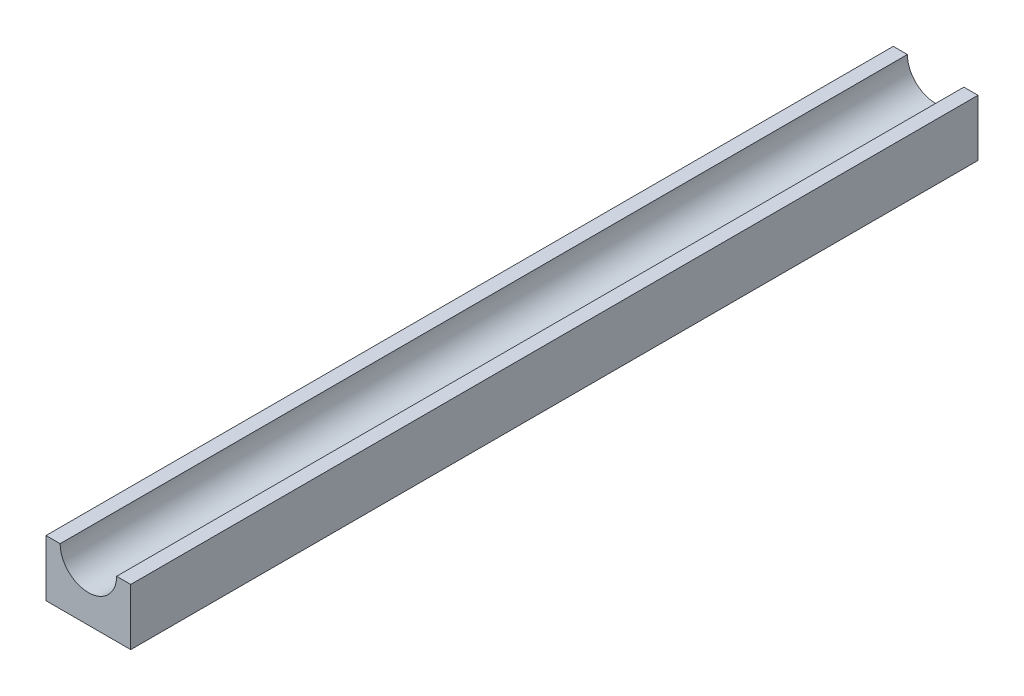
ISO-10303-21;
HEADER;
FILE_DESCRIPTION(('STEP AP214'),'2;1');
FILE_NAME('part.step','',(''),(''),'','','');
FILE_SCHEMA(('AUTOMOTIVE_DESIGN { 1 0 10303 214 1 1 1 1 }'));
ENDSEC;
DATA;
#1=APPLICATION_CONTEXT('core data for automotive mechanical design processes');
#2=APPLICATION_PROTOCOL_DEFINITION('international standard','automotive_design',2000,#1);
#3=PRODUCT_CONTEXT('',#1,'mechanical');
#4=PRODUCT('Part','Part','',(#3));
#5=PRODUCT_RELATED_PRODUCT_CATEGORY('part','',(#4));
#6=PRODUCT_DEFINITION_FORMATION('','',#4);
#7=PRODUCT_DEFINITION_CONTEXT('part definition',#1,'design');
#8=PRODUCT_DEFINITION('design','',#6,#7);
#9=PRODUCT_DEFINITION_SHAPE('','',#8);
#10=(LENGTH_UNIT() NAMED_UNIT(*) SI_UNIT(.MILLI.,.METRE.));
#11=(NAMED_UNIT(*) PLANE_ANGLE_UNIT() SI_UNIT($,.RADIAN.));
#12=(NAMED_UNIT(*) SI_UNIT($,.STERADIAN.) SOLID_ANGLE_UNIT());
#13=UNCERTAINTY_MEASURE_WITH_UNIT(LENGTH_MEASURE(1.E-05),#10,'distance_accuracy_value','');
#14=(GEOMETRIC_REPRESENTATION_CONTEXT(3) GLOBAL_UNCERTAINTY_ASSIGNED_CONTEXT((#13)) GLOBAL_UNIT_ASSIGNED_CONTEXT((#10,
#11,#12)) REPRESENTATION_CONTEXT('',''));
#15=CARTESIAN_POINT('',(0.,0.,0.));
#16=DIRECTION('',(0.,0.,1.));
#17=DIRECTION('',(1.,0.,0.));
#18=AXIS2_PLACEMENT_3D('',#15,#16,#17);
#19=CARTESIAN_POINT('',(0.,5.,150.));
#20=DIRECTION('',(0.,0.,-1.));
#21=DIRECTION('',(-1.,0.,0.));
#22=AXIS2_PLACEMENT_3D('',#19,#20,#21);
#23=CYLINDRICAL_SURFACE('',#22,5.);
#24=CARTESIAN_POINT('',(0.,5.,0.));
#25=DIRECTION('',(0.,0.,1.));
#26=DIRECTION('',(1.,0.,0.));
#27=AXIS2_PLACEMENT_3D('',#24,#25,#26);
#28=CIRCLE('',#27,5.);
#29=CARTESIAN_POINT('',(-5.,5.,0.));
#30=VERTEX_POINT('',#29);
#31=CARTESIAN_POINT('',(5.,5.,0.));
#32=VERTEX_POINT('',#31);
#33=EDGE_CURVE('E244',#30,#32,#28,.T.);
#34=ORIENTED_EDGE('',*,*,#33,.F.);
#35=DIRECTION('',(0.,0.,-1.));
#36=VECTOR('',#35,1.);
#37=CARTESIAN_POINT('',(-5.,5.,150.));
#38=LINE('',#37,#36);
#39=CARTESIAN_POINT('',(-5.,5.,150.));
#40=VERTEX_POINT('',#39);
#41=EDGE_CURVE('E299',#40,#30,#38,.T.);
#42=ORIENTED_EDGE('',*,*,#41,.F.);
#43=CARTESIAN_POINT('',(0.,5.,150.));
#44=DIRECTION('',(0.,0.,1.));
#45=DIRECTION('',(1.,0.,0.));
#46=AXIS2_PLACEMENT_3D('',#43,#44,#45);
#47=CIRCLE('',#46,5.);
#48=CARTESIAN_POINT('',(5.,5.,150.));
#49=VERTEX_POINT('',#48);
#50=EDGE_CURVE('E245',#40,#49,#47,.T.);
#51=ORIENTED_EDGE('',*,*,#50,.T.);
#52=DIRECTION('',(0.,0.,-1.));
#53=VECTOR('',#52,1.);
#54=CARTESIAN_POINT('',(5.,5.,150.));
#55=LINE('',#54,#53);
#56=EDGE_CURVE('E283',#49,#32,#55,.T.);
#57=ORIENTED_EDGE('',*,*,#56,.T.);
#58=EDGE_LOOP('',(#34,#42,#51,#57));
#59=FACE_BOUND('',#58,.T.);
#60=ADVANCED_FACE('F41',(#59),#23,.F.);
#61=CARTESIAN_POINT('',(0.,5.,150.));
#62=DIRECTION('',(0.,1.,0.));
#63=DIRECTION('',(0.,0.,1.));
#64=AXIS2_PLACEMENT_3D('',#61,#62,#63);
#65=PLANE('',#64);
#66=DIRECTION('',(1.,0.,0.));
#67=VECTOR('',#66,1.);
#68=CARTESIAN_POINT('',(0.,5.,0.));
#69=LINE('',#68,#67);
#70=CARTESIAN_POINT('',(-7.5,5.,0.));
#71=VERTEX_POINT('',#70);
#72=EDGE_CURVE('E268',#71,#30,#69,.T.);
#73=ORIENTED_EDGE('',*,*,#72,.F.);
#74=DIRECTION('',(0.,0.,-1.));
#75=VECTOR('',#74,1.);
#76=CARTESIAN_POINT('',(-7.5,5.,150.));
#77=LINE('',#76,#75);
#78=CARTESIAN_POINT('',(-7.5,5.,150.));
#79=VERTEX_POINT('',#78);
#80=EDGE_CURVE('E296',#79,#71,#77,.T.);
#81=ORIENTED_EDGE('',*,*,#80,.F.);
#82=DIRECTION('',(1.,0.,0.));
#83=VECTOR('',#82,1.);
#84=CARTESIAN_POINT('',(0.,5.,150.));
#85=LINE('',#84,#83);
#86=EDGE_CURVE('E249',#79,#40,#85,.T.);
#87=ORIENTED_EDGE('',*,*,#86,.T.);
#88=ORIENTED_EDGE('',*,*,#41,.T.);
#89=EDGE_LOOP('',(#73,#81,#87,#88));
#90=FACE_BOUND('',#89,.T.);
#91=ADVANCED_FACE('F340',(#90),#65,.T.);
#92=CARTESIAN_POINT('',(-7.5,0.,150.));
#93=DIRECTION('',(1.,0.,0.));
#94=DIRECTION('',(0.,1.,0.));
#95=AXIS2_PLACEMENT_3D('',#92,#93,#94);
#96=PLANE('',#95);
#97=DIRECTION('',(0.,-1.,0.));
#98=VECTOR('',#97,1.);
#99=CARTESIAN_POINT('',(-7.5,0.,0.));
#100=LINE('',#99,#98);
#101=CARTESIAN_POINT('',(-7.5,-5.,0.));
#102=VERTEX_POINT('',#101);
#103=EDGE_CURVE('E272',#71,#102,#100,.T.);
#104=ORIENTED_EDGE('',*,*,#103,.T.);
#105=DIRECTION('',(0.,0.,-1.));
#106=VECTOR('',#105,1.);
#107=CARTESIAN_POINT('',(-7.5,-5.,150.));
#108=LINE('',#107,#106);
#109=CARTESIAN_POINT('',(-7.5,-5.,150.));
#110=VERTEX_POINT('',#109);
#111=EDGE_CURVE('E292',#110,#102,#108,.T.);
#112=ORIENTED_EDGE('',*,*,#111,.F.);
#113=DIRECTION('',(0.,-1.,0.));
#114=VECTOR('',#113,1.);
#115=CARTESIAN_POINT('',(-7.5,0.,150.));
#116=LINE('',#115,#114);
#117=EDGE_CURVE('E254',#79,#110,#116,.T.);
#118=ORIENTED_EDGE('',*,*,#117,.F.);
#119=ORIENTED_EDGE('',*,*,#80,.T.);
#120=EDGE_LOOP('',(#104,#112,#118,#119));
#121=FACE_BOUND('',#120,.T.);
#122=ADVANCED_FACE('F345',(#121),#96,.F.);
#123=CARTESIAN_POINT('',(0.,-5.,150.));
#124=DIRECTION('',(0.,1.,0.));
#125=DIRECTION('',(0.,0.,1.));
#126=AXIS2_PLACEMENT_3D('',#123,#124,#125);
#127=PLANE('',#126);
#128=DIRECTION('',(1.,0.,0.));
#129=VECTOR('',#128,1.);
#130=CARTESIAN_POINT('',(-1.5,-5.00000000000001,12.5));
#131=LINE('',#130,#129);
#132=CARTESIAN_POINT('',(-1.5,-5.,12.5));
#133=VERTEX_POINT('',#132);
#134=CARTESIAN_POINT('',(1.5,-5.,12.5));
#135=VERTEX_POINT('',#134);
#136=EDGE_CURVE('E63',#133,#135,#131,.T.);
#137=ORIENTED_EDGE('',*,*,#136,.F.);
#138=DIRECTION('',(0.,0.,-1.));
#139=VECTOR('',#138,1.);
#140=CARTESIAN_POINT('',(-1.5,-5.00000000000001,90.));
#141=LINE('',#140,#139);
#142=CARTESIAN_POINT('',(-1.5,-5.,17.5));
#143=VERTEX_POINT('',#142);
#144=EDGE_CURVE('E58',#143,#133,#141,.T.);
#145=ORIENTED_EDGE('',*,*,#144,.F.);
#146=DIRECTION('',(1.,0.,0.));
#147=VECTOR('',#146,1.);
#148=CARTESIAN_POINT('',(-1.5,-5.00000000000001,17.5));
#149=LINE('',#148,#147);
#150=CARTESIAN_POINT('',(1.5,-5.00000000000001,17.5));
#151=VERTEX_POINT('',#150);
#152=EDGE_CURVE('E185',#143,#151,#149,.T.);
#153=ORIENTED_EDGE('',*,*,#152,.T.);
#154=DIRECTION('',(0.,0.,-1.));
#155=VECTOR('',#154,1.);
#156=CARTESIAN_POINT('',(1.5,-5.00000000000001,90.));
#157=LINE('',#156,#155);
#158=EDGE_CURVE('E174',#151,#135,#157,.T.);
#159=ORIENTED_EDGE('',*,*,#158,.T.);
#160=EDGE_LOOP('',(#137,#145,#153,#159));
#161=FACE_BOUND('',#160,.T.);
#162=DIRECTION('',(1.,0.,0.));
#163=VECTOR('',#162,1.);
#164=CARTESIAN_POINT('',(-1.5,-5.00000000000001,72.5));
#165=LINE('',#164,#163);
#166=CARTESIAN_POINT('',(-1.5,-5.,72.5));
#167=VERTEX_POINT('',#166);
#168=CARTESIAN_POINT('',(1.5,-5.,72.5));
#169=VERTEX_POINT('',#168);
#170=EDGE_CURVE('E216',#167,#169,#165,.T.);
#171=ORIENTED_EDGE('',*,*,#170,.F.);
#172=DIRECTION('',(0.,0.,1.));
#173=VECTOR('',#172,1.);
#174=CARTESIAN_POINT('',(-1.5,-5.00000000000001,0.));
#175=LINE('',#174,#173);
#176=CARTESIAN_POINT('',(-1.5,-5.,77.5));
#177=VERTEX_POINT('',#176);
#178=EDGE_CURVE('E213',#167,#177,#175,.T.);
#179=ORIENTED_EDGE('',*,*,#178,.T.);
#180=DIRECTION('',(1.,0.,0.));
#181=VECTOR('',#180,1.);
#182=CARTESIAN_POINT('',(-1.5,-5.00000000000001,77.5));
#183=LINE('',#182,#181);
#184=CARTESIAN_POINT('',(1.5,-5.00000000000001,77.5));
#185=VERTEX_POINT('',#184);
#186=EDGE_CURVE('E234',#177,#185,#183,.T.);
#187=ORIENTED_EDGE('',*,*,#186,.T.);
#188=DIRECTION('',(0.,0.,1.));
#189=VECTOR('',#188,1.);
#190=CARTESIAN_POINT('',(1.5,-5.00000000000001,0.));
#191=LINE('',#190,#189);
#192=EDGE_CURVE('E206',#169,#185,#191,.T.);
#193=ORIENTED_EDGE('',*,*,#192,.F.);
#194=EDGE_LOOP('',(#171,#179,#187,#193));
#195=FACE_BOUND('',#194,.T.);
#196=DIRECTION('',(1.,0.,0.));
#197=VECTOR('',#196,1.);
#198=CARTESIAN_POINT('',(0.,-5.,0.));
#199=LINE('',#198,#197);
#200=CARTESIAN_POINT('',(7.5,-5.,0.));
#201=VERTEX_POINT('',#200);
#202=EDGE_CURVE('E275',#102,#201,#199,.T.);
#203=ORIENTED_EDGE('',*,*,#202,.T.);
#204=DIRECTION('',(0.,0.,-1.));
#205=VECTOR('',#204,1.);
#206=CARTESIAN_POINT('',(7.5,-5.,150.));
#207=LINE('',#206,#205);
#208=CARTESIAN_POINT('',(7.5,-5.,150.));
#209=VERTEX_POINT('',#208);
#210=EDGE_CURVE('E289',#209,#201,#207,.T.);
#211=ORIENTED_EDGE('',*,*,#210,.F.);
#212=DIRECTION('',(1.,0.,0.));
#213=VECTOR('',#212,1.);
#214=CARTESIAN_POINT('',(0.,-5.,150.));
#215=LINE('',#214,#213);
#216=EDGE_CURVE('E258',#110,#209,#215,.T.);
#217=ORIENTED_EDGE('',*,*,#216,.F.);
#218=ORIENTED_EDGE('',*,*,#111,.T.);
#219=EDGE_LOOP('',(#203,#211,#217,#218));
#220=FACE_BOUND('',#219,.T.);
#221=ADVANCED_FACE('F320',(#161,#195,#220),#127,.F.);
#222=CARTESIAN_POINT('',(7.5,0.,150.));
#223=DIRECTION('',(1.,0.,0.));
#224=DIRECTION('',(0.,1.,0.));
#225=AXIS2_PLACEMENT_3D('',#222,#223,#224);
#226=PLANE('',#225);
#227=DIRECTION('',(0.,-1.,0.));
#228=VECTOR('',#227,1.);
#229=CARTESIAN_POINT('',(7.5,0.,0.));
#230=LINE('',#229,#228);
#231=CARTESIAN_POINT('',(7.5,5.,0.));
#232=VERTEX_POINT('',#231);
#233=EDGE_CURVE('E279',#232,#201,#230,.T.);
#234=ORIENTED_EDGE('',*,*,#233,.F.);
#235=DIRECTION('',(0.,0.,-1.));
#236=VECTOR('',#235,1.);
#237=CARTESIAN_POINT('',(7.5,5.,150.));
#238=LINE('',#237,#236);
#239=CARTESIAN_POINT('',(7.5,5.,150.));
#240=VERTEX_POINT('',#239);
#241=EDGE_CURVE('E286',#240,#232,#238,.T.);
#242=ORIENTED_EDGE('',*,*,#241,.F.);
#243=DIRECTION('',(0.,-1.,0.));
#244=VECTOR('',#243,1.);
#245=CARTESIAN_POINT('',(7.5,0.,150.));
#246=LINE('',#245,#244);
#247=EDGE_CURVE('E261',#240,#209,#246,.T.);
#248=ORIENTED_EDGE('',*,*,#247,.T.);
#249=ORIENTED_EDGE('',*,*,#210,.T.);
#250=EDGE_LOOP('',(#234,#242,#248,#249));
#251=FACE_BOUND('',#250,.T.);
#252=ADVANCED_FACE('F371',(#251),#226,.T.);
#253=EDGE_CURVE('E250',#32,#232,#69,.T.);
#254=ORIENTED_EDGE('',*,*,#253,.F.);
#255=ORIENTED_EDGE('',*,*,#56,.F.);
#256=EDGE_CURVE('E255',#49,#240,#85,.T.);
#257=ORIENTED_EDGE('',*,*,#256,.T.);
#258=ORIENTED_EDGE('',*,*,#241,.T.);
#259=EDGE_LOOP('',(#254,#255,#257,#258));
#260=FACE_BOUND('',#259,.T.);
#261=ADVANCED_FACE('F348',(#260),#65,.T.);
#262=CARTESIAN_POINT('',(0.,0.,150.));
#263=DIRECTION('',(0.,0.,1.));
#264=DIRECTION('',(1.,0.,0.));
#265=AXIS2_PLACEMENT_3D('',#262,#263,#264);
#266=PLANE('',#265);
#267=ORIENTED_EDGE('',*,*,#50,.F.);
#268=ORIENTED_EDGE('',*,*,#86,.F.);
#269=ORIENTED_EDGE('',*,*,#117,.T.);
#270=ORIENTED_EDGE('',*,*,#216,.T.);
#271=ORIENTED_EDGE('',*,*,#247,.F.);
#272=ORIENTED_EDGE('',*,*,#256,.F.);
#273=EDGE_LOOP('',(#267,#268,#269,#270,#271,#272));
#274=FACE_BOUND('',#273,.T.);
#275=ADVANCED_FACE('F361',(#274),#266,.T.);
#276=CARTESIAN_POINT('',(0.,0.,0.));
#277=DIRECTION('',(0.,0.,1.));
#278=DIRECTION('',(1.,0.,0.));
#279=AXIS2_PLACEMENT_3D('',#276,#277,#278);
#280=PLANE('',#279);
#281=ORIENTED_EDGE('',*,*,#33,.T.);
#282=ORIENTED_EDGE('',*,*,#253,.T.);
#283=ORIENTED_EDGE('',*,*,#233,.T.);
#284=ORIENTED_EDGE('',*,*,#202,.F.);
#285=ORIENTED_EDGE('',*,*,#103,.F.);
#286=ORIENTED_EDGE('',*,*,#72,.T.);
#287=EDGE_LOOP('',(#281,#282,#283,#284,#285,#286));
#288=FACE_BOUND('',#287,.T.);
#289=ADVANCED_FACE('F356',(#288),#280,.F.);
#290=CARTESIAN_POINT('',(-1.5,0.,72.5));
#291=DIRECTION('',(0.,0.,1.));
#292=DIRECTION('',(1.,0.,0.));
#293=AXIS2_PLACEMENT_3D('',#290,#291,#292);
#294=PLANE('',#293);
#295=DIRECTION('',(0.,-1.,0.));
#296=VECTOR('',#295,1.);
#297=CARTESIAN_POINT('',(1.5,0.,72.5));
#298=LINE('',#297,#296);
#299=CARTESIAN_POINT('',(1.5,-8.,72.5));
#300=VERTEX_POINT('',#299);
#301=EDGE_CURVE('E200',#169,#300,#298,.T.);
#302=ORIENTED_EDGE('',*,*,#301,.T.);
#303=DIRECTION('',(1.,0.,0.));
#304=VECTOR('',#303,1.);
#305=CARTESIAN_POINT('',(-1.5,-8.,72.5));
#306=LINE('',#305,#304);
#307=CARTESIAN_POINT('',(-1.5,-8.,72.5));
#308=VERTEX_POINT('',#307);
#309=EDGE_CURVE('E240',#308,#300,#306,.T.);
#310=ORIENTED_EDGE('',*,*,#309,.F.);
#311=DIRECTION('',(0.,-1.,0.));
#312=VECTOR('',#311,1.);
#313=CARTESIAN_POINT('',(-1.5,0.,72.5));
#314=LINE('',#313,#312);
#315=EDGE_CURVE('E201',#167,#308,#314,.T.);
#316=ORIENTED_EDGE('',*,*,#315,.F.);
#317=ORIENTED_EDGE('',*,*,#170,.T.);
#318=EDGE_LOOP('',(#302,#310,#316,#317));
#319=FACE_BOUND('',#318,.T.);
#320=ADVANCED_FACE('F316',(#319),#294,.F.);
#321=CARTESIAN_POINT('',(-1.5,-8.,75.));
#322=DIRECTION('',(1.,0.,0.));
#323=DIRECTION('',(0.,1.,0.));
#324=AXIS2_PLACEMENT_3D('',#321,#322,#323);
#325=CYLINDRICAL_SURFACE('',#324,2.50000000000001);
#326=CARTESIAN_POINT('',(1.5,-8.,75.));
#327=DIRECTION('',(-1.,0.,0.));
#328=DIRECTION('',(0.,-1.,0.));
#329=AXIS2_PLACEMENT_3D('',#326,#327,#328);
#330=CIRCLE('',#329,2.50000000000001);
#331=CARTESIAN_POINT('',(1.5,-8.,77.5));
#332=VERTEX_POINT('',#331);
#333=EDGE_CURVE('E220',#300,#332,#330,.T.);
#334=ORIENTED_EDGE('',*,*,#333,.T.);
#335=DIRECTION('',(1.,0.,0.));
#336=VECTOR('',#335,1.);
#337=CARTESIAN_POINT('',(-1.5,-8.,77.5));
#338=LINE('',#337,#336);
#339=CARTESIAN_POINT('',(-1.5,-8.,77.5));
#340=VERTEX_POINT('',#339);
#341=EDGE_CURVE('E237',#340,#332,#338,.T.);
#342=ORIENTED_EDGE('',*,*,#341,.F.);
#343=CARTESIAN_POINT('',(-1.5,-8.,75.));
#344=DIRECTION('',(-1.,0.,0.));
#345=DIRECTION('',(0.,-1.,0.));
#346=AXIS2_PLACEMENT_3D('',#343,#344,#345);
#347=CIRCLE('',#346,2.50000000000001);
#348=EDGE_CURVE('E205',#308,#340,#347,.T.);
#349=ORIENTED_EDGE('',*,*,#348,.F.);
#350=ORIENTED_EDGE('',*,*,#309,.T.);
#351=EDGE_LOOP('',(#334,#342,#349,#350));
#352=FACE_BOUND('',#351,.T.);
#353=ADVANCED_FACE('F329',(#352),#325,.T.);
#354=CARTESIAN_POINT('',(-1.5,0.,77.5));
#355=DIRECTION('',(0.,0.,1.));
#356=DIRECTION('',(1.,0.,0.));
#357=AXIS2_PLACEMENT_3D('',#354,#355,#356);
#358=PLANE('',#357);
#359=DIRECTION('',(0.,-1.,0.));
#360=VECTOR('',#359,1.);
#361=CARTESIAN_POINT('',(1.5,0.,77.5));
#362=LINE('',#361,#360);
#363=EDGE_CURVE('E224',#185,#332,#362,.T.);
#364=ORIENTED_EDGE('',*,*,#363,.F.);
#365=ORIENTED_EDGE('',*,*,#186,.F.);
#366=DIRECTION('',(0.,-1.,0.));
#367=VECTOR('',#366,1.);
#368=CARTESIAN_POINT('',(-1.5,0.,77.5));
#369=LINE('',#368,#367);
#370=EDGE_CURVE('E209',#177,#340,#369,.T.);
#371=ORIENTED_EDGE('',*,*,#370,.T.);
#372=ORIENTED_EDGE('',*,*,#341,.T.);
#373=EDGE_LOOP('',(#364,#365,#371,#372));
#374=FACE_BOUND('',#373,.T.);
#375=ADVANCED_FACE('F326',(#374),#358,.T.);
#376=CARTESIAN_POINT('',(-1.5,0.,0.));
#377=DIRECTION('',(-1.,0.,0.));
#378=DIRECTION('',(0.,-1.,0.));
#379=AXIS2_PLACEMENT_3D('',#376,#377,#378);
#380=PLANE('',#379);
#381=CARTESIAN_POINT('',(-1.5,-8.,75.));
#382=DIRECTION('',(-1.,0.,0.));
#383=DIRECTION('',(0.,-1.,0.));
#384=AXIS2_PLACEMENT_3D('',#381,#382,#383);
#385=CIRCLE('',#384,0.499999999999999);
#386=CARTESIAN_POINT('',(-1.5,-8.5,75.));
#387=VERTEX_POINT('',#386);
#388=EDGE_CURVE('E193',#387,#387,#385,.F.);
#389=ORIENTED_EDGE('',*,*,#388,.T.);
#390=EDGE_LOOP('',(#389));
#391=FACE_BOUND('',#390,.T.);
#392=ORIENTED_EDGE('',*,*,#315,.T.);
#393=ORIENTED_EDGE('',*,*,#348,.T.);
#394=ORIENTED_EDGE('',*,*,#370,.F.);
#395=ORIENTED_EDGE('',*,*,#178,.F.);
#396=EDGE_LOOP('',(#392,#393,#394,#395));
#397=FACE_BOUND('',#396,.T.);
#398=ADVANCED_FACE('F311',(#391,#397),#380,.T.);
#399=CARTESIAN_POINT('',(1.5,0.,0.));
#400=DIRECTION('',(-1.,0.,0.));
#401=DIRECTION('',(0.,-1.,0.));
#402=AXIS2_PLACEMENT_3D('',#399,#400,#401);
#403=PLANE('',#402);
#404=CARTESIAN_POINT('',(1.5,-8.,75.));
#405=DIRECTION('',(-1.,0.,0.));
#406=DIRECTION('',(0.,-1.,0.));
#407=AXIS2_PLACEMENT_3D('',#404,#405,#406);
#408=CIRCLE('',#407,0.499999999999999);
#409=CARTESIAN_POINT('',(1.5,-8.49999999999999,75.));
#410=VERTEX_POINT('',#409);
#411=EDGE_CURVE('E50',#410,#410,#408,.F.);
#412=ORIENTED_EDGE('',*,*,#411,.F.);
#413=EDGE_LOOP('',(#412));
#414=FACE_BOUND('',#413,.T.);
#415=ORIENTED_EDGE('',*,*,#301,.F.);
#416=ORIENTED_EDGE('',*,*,#192,.T.);
#417=ORIENTED_EDGE('',*,*,#363,.T.);
#418=ORIENTED_EDGE('',*,*,#333,.F.);
#419=EDGE_LOOP('',(#415,#416,#417,#418));
#420=FACE_BOUND('',#419,.T.);
#421=ADVANCED_FACE('F307',(#414,#420),#403,.F.);
#422=CARTESIAN_POINT('',(4.,-8.,75.));
#423=DIRECTION('',(-1.,0.,0.));
#424=DIRECTION('',(0.,-1.,0.));
#425=AXIS2_PLACEMENT_3D('',#422,#423,#424);
#426=PLANE('',#425);
#427=CARTESIAN_POINT('',(4.,-8.,75.));
#428=DIRECTION('',(-1.,0.,0.));
#429=DIRECTION('',(0.,-1.,0.));
#430=AXIS2_PLACEMENT_3D('',#427,#428,#429);
#431=CIRCLE('',#430,0.499999999999999);
#432=CARTESIAN_POINT('',(4.,-8.49999999999999,75.));
#433=VERTEX_POINT('',#432);
#434=EDGE_CURVE('E188',#433,#433,#431,.T.);
#435=ORIENTED_EDGE('',*,*,#434,.F.);
#436=EDGE_LOOP('',(#435));
#437=FACE_BOUND('',#436,.T.);
#438=ADVANCED_FACE('F310',(#437),#426,.F.);
#439=CARTESIAN_POINT('',(-4.,-8.,75.));
#440=DIRECTION('',(1.,0.,0.));
#441=DIRECTION('',(0.,1.,0.));
#442=AXIS2_PLACEMENT_3D('',#439,#440,#441);
#443=CYLINDRICAL_SURFACE('',#442,0.499999999999999);
#444=ORIENTED_EDGE('',*,*,#434,.T.);
#445=EDGE_LOOP('',(#444));
#446=FACE_BOUND('',#445,.T.);
#447=ORIENTED_EDGE('',*,*,#411,.T.);
#448=EDGE_LOOP('',(#447));
#449=FACE_BOUND('',#448,.T.);
#450=ADVANCED_FACE('F305',(#446,#449),#443,.T.);
#451=ORIENTED_EDGE('',*,*,#388,.F.);
#452=EDGE_LOOP('',(#451));
#453=FACE_BOUND('',#452,.T.);
#454=CARTESIAN_POINT('',(-4.,-8.,75.));
#455=DIRECTION('',(-1.,0.,0.));
#456=DIRECTION('',(0.,-1.,0.));
#457=AXIS2_PLACEMENT_3D('',#454,#455,#456);
#458=CIRCLE('',#457,0.499999999999999);
#459=CARTESIAN_POINT('',(-4.,-8.5,75.));
#460=VERTEX_POINT('',#459);
#461=EDGE_CURVE('E189',#460,#460,#458,.T.);
#462=ORIENTED_EDGE('',*,*,#461,.F.);
#463=EDGE_LOOP('',(#462));
#464=FACE_BOUND('',#463,.T.);
#465=ADVANCED_FACE('F429',(#453,#464),#443,.T.);
#466=CARTESIAN_POINT('',(-4.,-8.,75.));
#467=DIRECTION('',(-1.,0.,0.));
#468=DIRECTION('',(0.,-1.,0.));
#469=AXIS2_PLACEMENT_3D('',#466,#467,#468);
#470=PLANE('',#469);
#471=ORIENTED_EDGE('',*,*,#461,.T.);
#472=EDGE_LOOP('',(#471));
#473=FACE_BOUND('',#472,.T.);
#474=ADVANCED_FACE('F438',(#473),#470,.T.);
#475=CARTESIAN_POINT('',(-1.5,0.,17.5));
#476=DIRECTION('',(0.,0.,1.));
#477=DIRECTION('',(1.,0.,0.));
#478=AXIS2_PLACEMENT_3D('',#475,#476,#477);
#479=PLANE('',#478);
#480=DIRECTION('',(0.,-1.,0.));
#481=VECTOR('',#480,1.);
#482=CARTESIAN_POINT('',(1.5,0.,17.5));
#483=LINE('',#482,#481);
#484=CARTESIAN_POINT('',(1.5,-8.,17.5));
#485=VERTEX_POINT('',#484);
#486=EDGE_CURVE('E170',#151,#485,#483,.T.);
#487=ORIENTED_EDGE('',*,*,#486,.F.);
#488=ORIENTED_EDGE('',*,*,#152,.F.);
#489=DIRECTION('',(0.,-1.,0.));
#490=VECTOR('',#489,1.);
#491=CARTESIAN_POINT('',(-1.5,0.,17.5));
#492=LINE('',#491,#490);
#493=CARTESIAN_POINT('',(-1.5,-8.,17.5));
#494=VERTEX_POINT('',#493);
#495=EDGE_CURVE('E181',#143,#494,#492,.T.);
#496=ORIENTED_EDGE('',*,*,#495,.T.);
#497=DIRECTION('',(1.,0.,0.));
#498=VECTOR('',#497,1.);
#499=CARTESIAN_POINT('',(-1.5,-8.,17.5));
#500=LINE('',#499,#498);
#501=EDGE_CURVE('E160',#494,#485,#500,.T.);
#502=ORIENTED_EDGE('',*,*,#501,.T.);
#503=EDGE_LOOP('',(#487,#488,#496,#502));
#504=FACE_BOUND('',#503,.T.);
#505=ADVANCED_FACE('F447',(#504),#479,.T.);
#506=CARTESIAN_POINT('',(-1.5,0.,12.5));
#507=DIRECTION('',(0.,0.,1.));
#508=DIRECTION('',(1.,0.,0.));
#509=AXIS2_PLACEMENT_3D('',#506,#507,#508);
#510=PLANE('',#509);
#511=DIRECTION('',(0.,-1.,0.));
#512=VECTOR('',#511,1.);
#513=CARTESIAN_POINT('',(1.5,0.,12.5));
#514=LINE('',#513,#512);
#515=CARTESIAN_POINT('',(1.5,-8.,12.5));
#516=VERTEX_POINT('',#515);
#517=EDGE_CURVE('E155',#135,#516,#514,.T.);
#518=ORIENTED_EDGE('',*,*,#517,.T.);
#519=DIRECTION('',(1.,0.,0.));
#520=VECTOR('',#519,1.);
#521=CARTESIAN_POINT('',(-1.5,-8.,12.5));
#522=LINE('',#521,#520);
#523=CARTESIAN_POINT('',(-1.5,-8.,12.5));
#524=VERTEX_POINT('',#523);
#525=EDGE_CURVE('E152',#524,#516,#522,.T.);
#526=ORIENTED_EDGE('',*,*,#525,.F.);
#527=DIRECTION('',(0.,-1.,0.));
#528=VECTOR('',#527,1.);
#529=CARTESIAN_POINT('',(-1.5,0.,12.5));
#530=LINE('',#529,#528);
#531=EDGE_CURVE('E142',#133,#524,#530,.T.);
#532=ORIENTED_EDGE('',*,*,#531,.F.);
#533=ORIENTED_EDGE('',*,*,#136,.T.);
#534=EDGE_LOOP('',(#518,#526,#532,#533));
#535=FACE_BOUND('',#534,.T.);
#536=ADVANCED_FACE('F153',(#535),#510,.F.);
#537=CARTESIAN_POINT('',(-1.5,-8.,15.));
#538=DIRECTION('',(1.,0.,0.));
#539=DIRECTION('',(0.,1.,0.));
#540=AXIS2_PLACEMENT_3D('',#537,#538,#539);
#541=CYLINDRICAL_SURFACE('',#540,2.50000000000001);
#542=CARTESIAN_POINT('',(1.5,-8.,15.));
#543=DIRECTION('',(1.,0.,0.));
#544=DIRECTION('',(0.,-1.,0.));
#545=AXIS2_PLACEMENT_3D('',#542,#543,#544);
#546=CIRCLE('',#545,2.50000000000001);
#547=EDGE_CURVE('E179',#485,#516,#546,.T.);
#548=ORIENTED_EDGE('',*,*,#547,.F.);
#549=ORIENTED_EDGE('',*,*,#501,.F.);
#550=CARTESIAN_POINT('',(-1.5,-8.,15.));
#551=DIRECTION('',(1.,0.,0.));
#552=DIRECTION('',(0.,-1.,0.));
#553=AXIS2_PLACEMENT_3D('',#550,#551,#552);
#554=CIRCLE('',#553,2.50000000000001);
#555=EDGE_CURVE('E147',#494,#524,#554,.T.);
#556=ORIENTED_EDGE('',*,*,#555,.T.);
#557=ORIENTED_EDGE('',*,*,#525,.T.);
#558=EDGE_LOOP('',(#548,#549,#556,#557));
#559=FACE_BOUND('',#558,.T.);
#560=ADVANCED_FACE('F162',(#559),#541,.T.);
#561=CARTESIAN_POINT('',(-1.5,0.,90.));
#562=DIRECTION('',(-1.,0.,0.));
#563=DIRECTION('',(0.,-1.,0.));
#564=AXIS2_PLACEMENT_3D('',#561,#562,#563);
#565=PLANE('',#564);
#566=CARTESIAN_POINT('',(-1.5,-8.,15.));
#567=DIRECTION('',(-1.,0.,0.));
#568=DIRECTION('',(0.,-1.,0.));
#569=AXIS2_PLACEMENT_3D('',#566,#567,#568);
#570=CIRCLE('',#569,0.499999999999999);
#571=CARTESIAN_POINT('',(-1.5,-8.5,15.));
#572=VERTEX_POINT('',#571);
#573=EDGE_CURVE('E11',#572,#572,#570,.T.);
#574=ORIENTED_EDGE('',*,*,#573,.F.);
#575=EDGE_LOOP('',(#574));
#576=FACE_BOUND('',#575,.T.);
#577=ORIENTED_EDGE('',*,*,#495,.F.);
#578=ORIENTED_EDGE('',*,*,#144,.T.);
#579=ORIENTED_EDGE('',*,*,#531,.T.);
#580=ORIENTED_EDGE('',*,*,#555,.F.);
#581=EDGE_LOOP('',(#577,#578,#579,#580));
#582=FACE_BOUND('',#581,.T.);
#583=ADVANCED_FACE('F145',(#576,#582),#565,.T.);
#584=CARTESIAN_POINT('',(1.5,0.,90.));
#585=DIRECTION('',(-1.,0.,0.));
#586=DIRECTION('',(0.,-1.,0.));
#587=AXIS2_PLACEMENT_3D('',#584,#585,#586);
#588=PLANE('',#587);
#589=CARTESIAN_POINT('',(1.5,-8.,15.));
#590=DIRECTION('',(-1.,0.,0.));
#591=DIRECTION('',(0.,-1.,0.));
#592=AXIS2_PLACEMENT_3D('',#589,#590,#591);
#593=CIRCLE('',#592,0.499999999999999);
#594=CARTESIAN_POINT('',(1.5,-8.49999999999999,15.));
#595=VERTEX_POINT('',#594);
#596=EDGE_CURVE('E44',#595,#595,#593,.T.);
#597=ORIENTED_EDGE('',*,*,#596,.T.);
#598=EDGE_LOOP('',(#597));
#599=FACE_BOUND('',#598,.T.);
#600=ORIENTED_EDGE('',*,*,#486,.T.);
#601=ORIENTED_EDGE('',*,*,#547,.T.);
#602=ORIENTED_EDGE('',*,*,#517,.F.);
#603=ORIENTED_EDGE('',*,*,#158,.F.);
#604=EDGE_LOOP('',(#600,#601,#602,#603));
#605=FACE_BOUND('',#604,.T.);
#606=ADVANCED_FACE('F491',(#599,#605),#588,.F.);
#607=CARTESIAN_POINT('',(4.,-8.,15.));
#608=DIRECTION('',(-1.,0.,0.));
#609=DIRECTION('',(0.,-1.,0.));
#610=AXIS2_PLACEMENT_3D('',#607,#608,#609);
#611=PLANE('',#610);
#612=CARTESIAN_POINT('',(4.,-8.,15.));
#613=DIRECTION('',(1.,0.,0.));
#614=DIRECTION('',(0.,-1.,0.));
#615=AXIS2_PLACEMENT_3D('',#612,#613,#614);
#616=CIRCLE('',#615,0.499999999999999);
#617=CARTESIAN_POINT('',(4.,-8.49999999999999,15.));
#618=VERTEX_POINT('',#617);
#619=EDGE_CURVE('E550',#618,#618,#616,.T.);
#620=ORIENTED_EDGE('',*,*,#619,.T.);
#621=EDGE_LOOP('',(#620));
#622=FACE_BOUND('',#621,.T.);
#623=ADVANCED_FACE('F502',(#622),#611,.F.);
#624=CARTESIAN_POINT('',(-4.,-8.,15.));
#625=DIRECTION('',(1.,0.,0.));
#626=DIRECTION('',(0.,1.,0.));
#627=AXIS2_PLACEMENT_3D('',#624,#625,#626);
#628=CYLINDRICAL_SURFACE('',#627,0.499999999999999);
#629=ORIENTED_EDGE('',*,*,#619,.F.);
#630=EDGE_LOOP('',(#629));
#631=FACE_BOUND('',#630,.T.);
#632=ORIENTED_EDGE('',*,*,#596,.F.);
#633=EDGE_LOOP('',(#632));
#634=FACE_BOUND('',#633,.T.);
#635=ADVANCED_FACE('F512',(#631,#634),#628,.T.);
#636=ORIENTED_EDGE('',*,*,#573,.T.);
#637=EDGE_LOOP('',(#636));
#638=FACE_BOUND('',#637,.T.);
#639=CARTESIAN_POINT('',(-4.,-8.,15.));
#640=DIRECTION('',(1.,0.,0.));
#641=DIRECTION('',(0.,-1.,0.));
#642=AXIS2_PLACEMENT_3D('',#639,#640,#641);
#643=CIRCLE('',#642,0.499999999999999);
#644=CARTESIAN_POINT('',(-4.,-8.5,15.));
#645=VERTEX_POINT('',#644);
#646=EDGE_CURVE('E547',#645,#645,#643,.T.);
#647=ORIENTED_EDGE('',*,*,#646,.T.);
#648=EDGE_LOOP('',(#647));
#649=FACE_BOUND('',#648,.T.);
#650=ADVANCED_FACE('F522',(#638,#649),#628,.T.);
#651=CARTESIAN_POINT('',(-4.,-8.,15.));
#652=DIRECTION('',(-1.,0.,0.));
#653=DIRECTION('',(0.,-1.,0.));
#654=AXIS2_PLACEMENT_3D('',#651,#652,#653);
#655=PLANE('',#654);
#656=ORIENTED_EDGE('',*,*,#646,.F.);
#657=EDGE_LOOP('',(#656));
#658=FACE_BOUND('',#657,.T.);
#659=ADVANCED_FACE('F532',(#658),#655,.T.);
#660=CLOSED_SHELL('',(#60,#91,#122,#221,#252,#261,#275,#289,#320,#353,#375,#398,#421,#438,#450,
#465,#474,#505,#536,#560,#583,#606,#623,#635,#650,#659));
#661=MANIFOLD_SOLID_BREP('B2',#660);
#662=ADVANCED_BREP_SHAPE_REPRESENTATION('',(#18,#661),#14);
#663=SHAPE_DEFINITION_REPRESENTATION(#9,#662);
ENDSEC;
END-ISO-10303-21;
